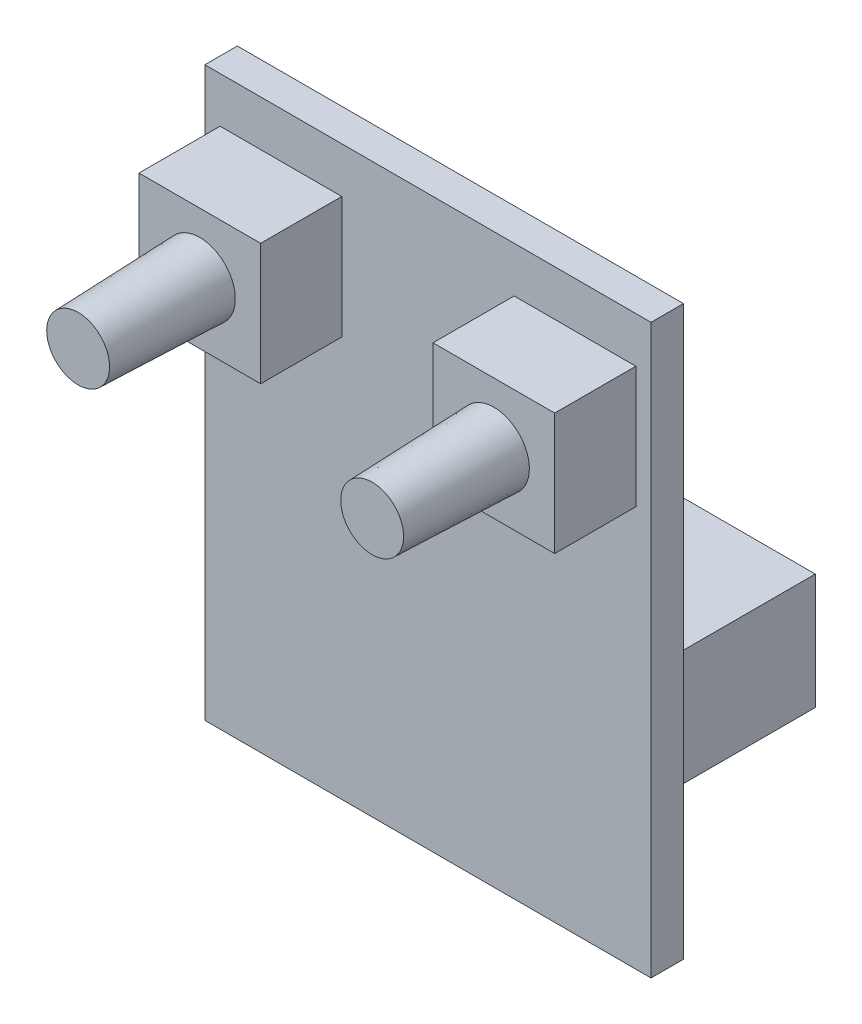
ISO-10303-21;
HEADER;
FILE_DESCRIPTION(('STEP AP214'),'2;1');
FILE_NAME('part.step','',(''),(''),'','','');
FILE_SCHEMA(('AUTOMOTIVE_DESIGN { 1 0 10303 214 1 1 1 1 }'));
ENDSEC;
DATA;
#1=APPLICATION_CONTEXT('core data for automotive mechanical design processes');
#2=APPLICATION_PROTOCOL_DEFINITION('international standard','automotive_design',2000,#1);
#3=PRODUCT_CONTEXT('',#1,'mechanical');
#4=PRODUCT('Part','Part','',(#3));
#5=PRODUCT_RELATED_PRODUCT_CATEGORY('part','',(#4));
#6=PRODUCT_DEFINITION_FORMATION('','',#4);
#7=PRODUCT_DEFINITION_CONTEXT('part definition',#1,'design');
#8=PRODUCT_DEFINITION('design','',#6,#7);
#9=PRODUCT_DEFINITION_SHAPE('','',#8);
#10=(LENGTH_UNIT() NAMED_UNIT(*) SI_UNIT(.MILLI.,.METRE.));
#11=(NAMED_UNIT(*) PLANE_ANGLE_UNIT() SI_UNIT($,.RADIAN.));
#12=(NAMED_UNIT(*) SI_UNIT($,.STERADIAN.) SOLID_ANGLE_UNIT());
#13=UNCERTAINTY_MEASURE_WITH_UNIT(LENGTH_MEASURE(1.E-05),#10,'distance_accuracy_value','');
#14=(GEOMETRIC_REPRESENTATION_CONTEXT(3) GLOBAL_UNCERTAINTY_ASSIGNED_CONTEXT((#13)) GLOBAL_UNIT_ASSIGNED_CONTEXT((#10,
#11,#12)) REPRESENTATION_CONTEXT('',''));
#15=CARTESIAN_POINT('',(0.,0.,0.));
#16=DIRECTION('',(0.,0.,1.));
#17=DIRECTION('',(1.,0.,0.));
#18=AXIS2_PLACEMENT_3D('',#15,#16,#17);
#19=CARTESIAN_POINT('',(0.,0.,5.6));
#20=DIRECTION('',(0.,0.,1.));
#21=DIRECTION('',(-1.,0.,0.));
#22=AXIS2_PLACEMENT_3D('',#19,#20,#21);
#23=PLANE('',#22);
#24=DIRECTION('',(0.,-1.,0.));
#25=VECTOR('',#24,1.);
#26=CARTESIAN_POINT('',(-4.25,25.75,5.6));
#27=LINE('',#26,#25);
#28=CARTESIAN_POINT('',(-4.25,25.75,5.6));
#29=VERTEX_POINT('',#28);
#30=CARTESIAN_POINT('',(-4.25,19.75,5.6));
#31=VERTEX_POINT('',#30);
#32=EDGE_CURVE('E181',#29,#31,#27,.T.);
#33=ORIENTED_EDGE('',*,*,#32,.F.);
#34=DIRECTION('',(1.,0.,0.));
#35=VECTOR('',#34,1.);
#36=CARTESIAN_POINT('',(-4.25,25.75,5.6));
#37=LINE('',#36,#35);
#38=CARTESIAN_POINT('',(-10.25,25.75,5.6));
#39=VERTEX_POINT('',#38);
#40=EDGE_CURVE('E196',#39,#29,#37,.T.);
#41=ORIENTED_EDGE('',*,*,#40,.F.);
#42=DIRECTION('',(0.,1.,0.));
#43=VECTOR('',#42,1.);
#44=CARTESIAN_POINT('',(-10.25,25.75,5.6));
#45=LINE('',#44,#43);
#46=CARTESIAN_POINT('',(-10.25,19.75,5.6));
#47=VERTEX_POINT('',#46);
#48=EDGE_CURVE('E203',#47,#39,#45,.T.);
#49=ORIENTED_EDGE('',*,*,#48,.F.);
#50=DIRECTION('',(-1.,0.,0.));
#51=VECTOR('',#50,1.);
#52=CARTESIAN_POINT('',(-4.25,19.75,5.6));
#53=LINE('',#52,#51);
#54=EDGE_CURVE('E199',#31,#47,#53,.T.);
#55=ORIENTED_EDGE('',*,*,#54,.F.);
#56=EDGE_LOOP('',(#33,#41,#49,#55));
#57=FACE_BOUND('',#56,.T.);
#58=CARTESIAN_POINT('',(-7.25,22.75,5.6));
#59=DIRECTION('',(0.,0.,-1.));
#60=DIRECTION('',(-1.,0.,0.));
#61=AXIS2_PLACEMENT_3D('',#58,#59,#60);
#62=CIRCLE('',#61,1.75);
#63=CARTESIAN_POINT('',(-9.,22.75,5.6));
#64=VERTEX_POINT('',#63);
#65=EDGE_CURVE('E212',#64,#64,#62,.T.);
#66=ORIENTED_EDGE('',*,*,#65,.T.);
#67=EDGE_LOOP('',(#66));
#68=FACE_BOUND('',#67,.T.);
#69=ADVANCED_FACE('F40',(#57,#68),#23,.T.);
#70=CARTESIAN_POINT('',(0.,0.,5.6));
#71=DIRECTION('',(0.,0.,1.));
#72=DIRECTION('',(1.,0.,0.));
#73=AXIS2_PLACEMENT_3D('',#70,#71,#72);
#74=PLANE('',#73);
#75=DIRECTION('',(0.,-1.,0.));
#76=VECTOR('',#75,1.);
#77=CARTESIAN_POINT('',(4.25,25.75,5.6));
#78=LINE('',#77,#76);
#79=CARTESIAN_POINT('',(4.25,25.75,5.6));
#80=VERTEX_POINT('',#79);
#81=CARTESIAN_POINT('',(4.25,19.75,5.6));
#82=VERTEX_POINT('',#81);
#83=EDGE_CURVE('E591',#80,#82,#78,.T.);
#84=ORIENTED_EDGE('',*,*,#83,.T.);
#85=DIRECTION('',(1.,0.,0.));
#86=VECTOR('',#85,1.);
#87=CARTESIAN_POINT('',(4.25,19.75,5.6));
#88=LINE('',#87,#86);
#89=CARTESIAN_POINT('',(10.25,19.75,5.6));
#90=VERTEX_POINT('',#89);
#91=EDGE_CURVE('E594',#82,#90,#88,.T.);
#92=ORIENTED_EDGE('',*,*,#91,.T.);
#93=DIRECTION('',(0.,1.,0.));
#94=VECTOR('',#93,1.);
#95=CARTESIAN_POINT('',(10.25,25.75,5.6));
#96=LINE('',#95,#94);
#97=CARTESIAN_POINT('',(10.25,25.75,5.6));
#98=VERTEX_POINT('',#97);
#99=EDGE_CURVE('E597',#90,#98,#96,.T.);
#100=ORIENTED_EDGE('',*,*,#99,.T.);
#101=DIRECTION('',(-1.,0.,0.));
#102=VECTOR('',#101,1.);
#103=CARTESIAN_POINT('',(4.25,25.75,5.6));
#104=LINE('',#103,#102);
#105=EDGE_CURVE('E599',#98,#80,#104,.T.);
#106=ORIENTED_EDGE('',*,*,#105,.T.);
#107=EDGE_LOOP('',(#84,#92,#100,#106));
#108=FACE_BOUND('',#107,.T.);
#109=CARTESIAN_POINT('',(7.25,22.75,5.6));
#110=DIRECTION('',(0.,0.,1.));
#111=DIRECTION('',(1.,0.,0.));
#112=AXIS2_PLACEMENT_3D('',#109,#110,#111);
#113=CIRCLE('',#112,1.75);
#114=CARTESIAN_POINT('',(9.,22.75,5.6));
#115=VERTEX_POINT('',#114);
#116=EDGE_CURVE('E525',#115,#115,#113,.T.);
#117=ORIENTED_EDGE('',*,*,#116,.F.);
#118=EDGE_LOOP('',(#117));
#119=FACE_BOUND('',#118,.T.);
#120=ADVANCED_FACE('F283',(#108,#119),#74,.T.);
#121=CARTESIAN_POINT('',(0.,0.,0.));
#122=DIRECTION('',(0.,0.,-1.));
#123=DIRECTION('',(-1.,0.,0.));
#124=AXIS2_PLACEMENT_3D('',#121,#122,#123);
#125=PLANE('',#124);
#126=DIRECTION('',(0.,-1.,0.));
#127=VECTOR('',#126,1.);
#128=CARTESIAN_POINT('',(-11.,0.,0.));
#129=LINE('',#128,#127);
#130=CARTESIAN_POINT('',(-11.,28.,0.));
#131=VERTEX_POINT('',#130);
#132=CARTESIAN_POINT('',(-11.,0.,0.));
#133=VERTEX_POINT('',#132);
#134=EDGE_CURVE('E623',#131,#133,#129,.T.);
#135=ORIENTED_EDGE('',*,*,#134,.F.);
#136=DIRECTION('',(-1.,0.,0.));
#137=VECTOR('',#136,1.);
#138=CARTESIAN_POINT('',(-11.,28.,0.));
#139=LINE('',#138,#137);
#140=CARTESIAN_POINT('',(11.,28.,0.));
#141=VERTEX_POINT('',#140);
#142=EDGE_CURVE('E628',#141,#131,#139,.T.);
#143=ORIENTED_EDGE('',*,*,#142,.F.);
#144=DIRECTION('',(0.,1.,0.));
#145=VECTOR('',#144,1.);
#146=CARTESIAN_POINT('',(11.,0.,0.));
#147=LINE('',#146,#145);
#148=CARTESIAN_POINT('',(11.,0.,0.));
#149=VERTEX_POINT('',#148);
#150=EDGE_CURVE('E639',#149,#141,#147,.T.);
#151=ORIENTED_EDGE('',*,*,#150,.F.);
#152=DIRECTION('',(1.,0.,0.));
#153=VECTOR('',#152,1.);
#154=CARTESIAN_POINT('',(-11.,0.,0.));
#155=LINE('',#154,#153);
#156=EDGE_CURVE('E637',#133,#149,#155,.T.);
#157=ORIENTED_EDGE('',*,*,#156,.F.);
#158=EDGE_LOOP('',(#135,#143,#151,#157));
#159=FACE_BOUND('',#158,.T.);
#160=DIRECTION('',(-1.,0.,0.));
#161=VECTOR('',#160,1.);
#162=CARTESIAN_POINT('',(10.5,7.,0.));
#163=LINE('',#162,#161);
#164=CARTESIAN_POINT('',(10.5,7.,0.));
#165=VERTEX_POINT('',#164);
#166=CARTESIAN_POINT('',(-2.,7.,0.));
#167=VERTEX_POINT('',#166);
#168=EDGE_CURVE('E575',#165,#167,#163,.T.);
#169=ORIENTED_EDGE('',*,*,#168,.F.);
#170=DIRECTION('',(0.,-1.,0.));
#171=VECTOR('',#170,1.);
#172=CARTESIAN_POINT('',(10.5,7.,0.));
#173=LINE('',#172,#171);
#174=CARTESIAN_POINT('',(10.5,12.7,0.));
#175=VERTEX_POINT('',#174);
#176=EDGE_CURVE('E561',#175,#165,#173,.T.);
#177=ORIENTED_EDGE('',*,*,#176,.F.);
#178=DIRECTION('',(1.,0.,0.));
#179=VECTOR('',#178,1.);
#180=CARTESIAN_POINT('',(10.5,12.7,0.));
#181=LINE('',#180,#179);
#182=CARTESIAN_POINT('',(-2.,12.7,0.));
#183=VERTEX_POINT('',#182);
#184=EDGE_CURVE('E566',#183,#175,#181,.T.);
#185=ORIENTED_EDGE('',*,*,#184,.F.);
#186=DIRECTION('',(0.,1.,0.));
#187=VECTOR('',#186,1.);
#188=CARTESIAN_POINT('',(-2.,7.,0.));
#189=LINE('',#188,#187);
#190=EDGE_CURVE('E577',#167,#183,#189,.T.);
#191=ORIENTED_EDGE('',*,*,#190,.F.);
#192=EDGE_LOOP('',(#169,#177,#185,#191));
#193=FACE_BOUND('',#192,.T.);
#194=DIRECTION('',(-1.,0.,0.));
#195=VECTOR('',#194,1.);
#196=CARTESIAN_POINT('',(-3.,7.,0.));
#197=LINE('',#196,#195);
#198=CARTESIAN_POINT('',(-3.,7.,0.));
#199=VERTEX_POINT('',#198);
#200=CARTESIAN_POINT('',(-10.5,7.,0.));
#201=VERTEX_POINT('',#200);
#202=EDGE_CURVE('E548',#199,#201,#197,.T.);
#203=ORIENTED_EDGE('',*,*,#202,.F.);
#204=DIRECTION('',(0.,-1.,0.));
#205=VECTOR('',#204,1.);
#206=CARTESIAN_POINT('',(-3.,7.,0.));
#207=LINE('',#206,#205);
#208=CARTESIAN_POINT('',(-3.,12.7,0.));
#209=VERTEX_POINT('',#208);
#210=EDGE_CURVE('E528',#209,#199,#207,.T.);
#211=ORIENTED_EDGE('',*,*,#210,.F.);
#212=DIRECTION('',(1.,0.,0.));
#213=VECTOR('',#212,1.);
#214=CARTESIAN_POINT('',(-3.,12.7,0.));
#215=LINE('',#214,#213);
#216=CARTESIAN_POINT('',(-10.5,12.7,0.));
#217=VERTEX_POINT('',#216);
#218=EDGE_CURVE('E539',#217,#209,#215,.T.);
#219=ORIENTED_EDGE('',*,*,#218,.F.);
#220=DIRECTION('',(0.,1.,0.));
#221=VECTOR('',#220,1.);
#222=CARTESIAN_POINT('',(-10.5,7.,0.));
#223=LINE('',#222,#221);
#224=EDGE_CURVE('E550',#201,#217,#223,.T.);
#225=ORIENTED_EDGE('',*,*,#224,.F.);
#226=EDGE_LOOP('',(#203,#211,#219,#225));
#227=FACE_BOUND('',#226,.T.);
#228=ADVANCED_FACE('F286',(#159,#193,#227),#125,.T.);
#229=CARTESIAN_POINT('',(0.,0.,1.6));
#230=DIRECTION('',(0.,0.,-1.));
#231=DIRECTION('',(-1.,0.,0.));
#232=AXIS2_PLACEMENT_3D('',#229,#230,#231);
#233=PLANE('',#232);
#234=DIRECTION('',(1.,0.,0.));
#235=VECTOR('',#234,1.);
#236=CARTESIAN_POINT('',(-4.25,25.75,1.6));
#237=LINE('',#236,#235);
#238=CARTESIAN_POINT('',(-10.25,25.75,1.6));
#239=VERTEX_POINT('',#238);
#240=CARTESIAN_POINT('',(-4.25,25.75,1.6));
#241=VERTEX_POINT('',#240);
#242=EDGE_CURVE('E211',#239,#241,#237,.T.);
#243=ORIENTED_EDGE('',*,*,#242,.T.);
#244=DIRECTION('',(0.,-1.,0.));
#245=VECTOR('',#244,1.);
#246=CARTESIAN_POINT('',(-4.25,25.75,1.6));
#247=LINE('',#246,#245);
#248=CARTESIAN_POINT('',(-4.25,19.75,1.6));
#249=VERTEX_POINT('',#248);
#250=EDGE_CURVE('E184',#241,#249,#247,.T.);
#251=ORIENTED_EDGE('',*,*,#250,.T.);
#252=DIRECTION('',(-1.,0.,0.));
#253=VECTOR('',#252,1.);
#254=CARTESIAN_POINT('',(-4.25,19.75,1.6));
#255=LINE('',#254,#253);
#256=CARTESIAN_POINT('',(-10.25,19.75,1.6));
#257=VERTEX_POINT('',#256);
#258=EDGE_CURVE('E200',#249,#257,#255,.T.);
#259=ORIENTED_EDGE('',*,*,#258,.T.);
#260=DIRECTION('',(0.,1.,0.));
#261=VECTOR('',#260,1.);
#262=CARTESIAN_POINT('',(-10.25,25.75,1.6));
#263=LINE('',#262,#261);
#264=EDGE_CURVE('E55',#257,#239,#263,.T.);
#265=ORIENTED_EDGE('',*,*,#264,.T.);
#266=EDGE_LOOP('',(#243,#251,#259,#265));
#267=FACE_BOUND('',#266,.T.);
#268=DIRECTION('',(0.,-1.,0.));
#269=VECTOR('',#268,1.);
#270=CARTESIAN_POINT('',(-11.,0.,1.6));
#271=LINE('',#270,#269);
#272=CARTESIAN_POINT('',(-11.,28.,1.6));
#273=VERTEX_POINT('',#272);
#274=CARTESIAN_POINT('',(-11.,0.,1.6));
#275=VERTEX_POINT('',#274);
#276=EDGE_CURVE('E624',#273,#275,#271,.T.);
#277=ORIENTED_EDGE('',*,*,#276,.T.);
#278=DIRECTION('',(1.,0.,0.));
#279=VECTOR('',#278,1.);
#280=CARTESIAN_POINT('',(-11.,0.,1.6));
#281=LINE('',#280,#279);
#282=CARTESIAN_POINT('',(11.,0.,1.6));
#283=VERTEX_POINT('',#282);
#284=EDGE_CURVE('E627',#275,#283,#281,.T.);
#285=ORIENTED_EDGE('',*,*,#284,.T.);
#286=DIRECTION('',(0.,1.,0.));
#287=VECTOR('',#286,1.);
#288=CARTESIAN_POINT('',(11.,0.,1.6));
#289=LINE('',#288,#287);
#290=CARTESIAN_POINT('',(11.,28.,1.6));
#291=VERTEX_POINT('',#290);
#292=EDGE_CURVE('E630',#283,#291,#289,.T.);
#293=ORIENTED_EDGE('',*,*,#292,.T.);
#294=DIRECTION('',(-1.,0.,0.));
#295=VECTOR('',#294,1.);
#296=CARTESIAN_POINT('',(-11.,28.,1.6));
#297=LINE('',#296,#295);
#298=EDGE_CURVE('E632',#291,#273,#297,.T.);
#299=ORIENTED_EDGE('',*,*,#298,.T.);
#300=EDGE_LOOP('',(#277,#285,#293,#299));
#301=FACE_BOUND('',#300,.T.);
#302=DIRECTION('',(0.,-1.,0.));
#303=VECTOR('',#302,1.);
#304=CARTESIAN_POINT('',(4.25,25.75,1.6));
#305=LINE('',#304,#303);
#306=CARTESIAN_POINT('',(4.25,25.75,1.6));
#307=VERTEX_POINT('',#306);
#308=CARTESIAN_POINT('',(4.25,19.75,1.6));
#309=VERTEX_POINT('',#308);
#310=EDGE_CURVE('E590',#307,#309,#305,.T.);
#311=ORIENTED_EDGE('',*,*,#310,.F.);
#312=DIRECTION('',(-1.,0.,0.));
#313=VECTOR('',#312,1.);
#314=CARTESIAN_POINT('',(4.25,25.75,1.6));
#315=LINE('',#314,#313);
#316=CARTESIAN_POINT('',(10.25,25.75,1.6));
#317=VERTEX_POINT('',#316);
#318=EDGE_CURVE('E595',#317,#307,#315,.T.);
#319=ORIENTED_EDGE('',*,*,#318,.F.);
#320=DIRECTION('',(0.,1.,0.));
#321=VECTOR('',#320,1.);
#322=CARTESIAN_POINT('',(10.25,25.75,1.6));
#323=LINE('',#322,#321);
#324=CARTESIAN_POINT('',(10.25,19.75,1.6));
#325=VERTEX_POINT('',#324);
#326=EDGE_CURVE('E607',#325,#317,#323,.T.);
#327=ORIENTED_EDGE('',*,*,#326,.F.);
#328=DIRECTION('',(1.,0.,0.));
#329=VECTOR('',#328,1.);
#330=CARTESIAN_POINT('',(4.25,19.75,1.6));
#331=LINE('',#330,#329);
#332=EDGE_CURVE('E604',#309,#325,#331,.T.);
#333=ORIENTED_EDGE('',*,*,#332,.F.);
#334=EDGE_LOOP('',(#311,#319,#327,#333));
#335=FACE_BOUND('',#334,.T.);
#336=ADVANCED_FACE('F304',(#267,#301,#335),#233,.F.);
#337=CARTESIAN_POINT('',(-11.,0.,1.6));
#338=DIRECTION('',(1.,0.,0.));
#339=DIRECTION('',(0.,0.,-1.));
#340=AXIS2_PLACEMENT_3D('',#337,#338,#339);
#341=PLANE('',#340);
#342=ORIENTED_EDGE('',*,*,#134,.T.);
#343=DIRECTION('',(0.,0.,-1.));
#344=VECTOR('',#343,1.);
#345=CARTESIAN_POINT('',(-11.,0.,1.6));
#346=LINE('',#345,#344);
#347=EDGE_CURVE('E12',#275,#133,#346,.T.);
#348=ORIENTED_EDGE('',*,*,#347,.F.);
#349=ORIENTED_EDGE('',*,*,#276,.F.);
#350=DIRECTION('',(0.,0.,-1.));
#351=VECTOR('',#350,1.);
#352=CARTESIAN_POINT('',(-11.,28.,1.6));
#353=LINE('',#352,#351);
#354=EDGE_CURVE('E634',#273,#131,#353,.T.);
#355=ORIENTED_EDGE('',*,*,#354,.T.);
#356=EDGE_LOOP('',(#342,#348,#349,#355));
#357=FACE_BOUND('',#356,.T.);
#358=ADVANCED_FACE('F42',(#357),#341,.F.);
#359=CARTESIAN_POINT('',(-11.,0.,1.6));
#360=DIRECTION('',(0.,1.,0.));
#361=DIRECTION('',(0.,0.,1.));
#362=AXIS2_PLACEMENT_3D('',#359,#360,#361);
#363=PLANE('',#362);
#364=ORIENTED_EDGE('',*,*,#156,.T.);
#365=DIRECTION('',(0.,0.,-1.));
#366=VECTOR('',#365,1.);
#367=CARTESIAN_POINT('',(11.,0.,1.6));
#368=LINE('',#367,#366);
#369=EDGE_CURVE('E48',#283,#149,#368,.T.);
#370=ORIENTED_EDGE('',*,*,#369,.F.);
#371=ORIENTED_EDGE('',*,*,#284,.F.);
#372=ORIENTED_EDGE('',*,*,#347,.T.);
#373=EDGE_LOOP('',(#364,#370,#371,#372));
#374=FACE_BOUND('',#373,.T.);
#375=ADVANCED_FACE('F316',(#374),#363,.F.);
#376=CARTESIAN_POINT('',(11.,0.,1.6));
#377=DIRECTION('',(-1.,0.,0.));
#378=DIRECTION('',(0.,0.,1.));
#379=AXIS2_PLACEMENT_3D('',#376,#377,#378);
#380=PLANE('',#379);
#381=ORIENTED_EDGE('',*,*,#150,.T.);
#382=DIRECTION('',(0.,0.,-1.));
#383=VECTOR('',#382,1.);
#384=CARTESIAN_POINT('',(11.,28.,1.6));
#385=LINE('',#384,#383);
#386=EDGE_CURVE('E644',#291,#141,#385,.T.);
#387=ORIENTED_EDGE('',*,*,#386,.F.);
#388=ORIENTED_EDGE('',*,*,#292,.F.);
#389=ORIENTED_EDGE('',*,*,#369,.T.);
#390=EDGE_LOOP('',(#381,#387,#388,#389));
#391=FACE_BOUND('',#390,.T.);
#392=ADVANCED_FACE('F313',(#391),#380,.F.);
#393=CARTESIAN_POINT('',(-11.,28.,1.6));
#394=DIRECTION('',(0.,-1.,0.));
#395=DIRECTION('',(0.,0.,-1.));
#396=AXIS2_PLACEMENT_3D('',#393,#394,#395);
#397=PLANE('',#396);
#398=ORIENTED_EDGE('',*,*,#142,.T.);
#399=ORIENTED_EDGE('',*,*,#354,.F.);
#400=ORIENTED_EDGE('',*,*,#298,.F.);
#401=ORIENTED_EDGE('',*,*,#386,.T.);
#402=EDGE_LOOP('',(#398,#399,#400,#401));
#403=FACE_BOUND('',#402,.T.);
#404=ADVANCED_FACE('F302',(#403),#397,.F.);
#405=CARTESIAN_POINT('',(4.25,25.75,5.6));
#406=DIRECTION('',(1.,0.,0.));
#407=DIRECTION('',(0.,0.,-1.));
#408=AXIS2_PLACEMENT_3D('',#405,#406,#407);
#409=PLANE('',#408);
#410=ORIENTED_EDGE('',*,*,#310,.T.);
#411=DIRECTION('',(0.,0.,-1.));
#412=VECTOR('',#411,1.);
#413=CARTESIAN_POINT('',(4.25,19.75,5.6));
#414=LINE('',#413,#412);
#415=EDGE_CURVE('E620',#82,#309,#414,.T.);
#416=ORIENTED_EDGE('',*,*,#415,.F.);
#417=ORIENTED_EDGE('',*,*,#83,.F.);
#418=DIRECTION('',(0.,0.,-1.));
#419=VECTOR('',#418,1.);
#420=CARTESIAN_POINT('',(4.25,25.75,5.6));
#421=LINE('',#420,#419);
#422=EDGE_CURVE('E601',#80,#307,#421,.T.);
#423=ORIENTED_EDGE('',*,*,#422,.T.);
#424=EDGE_LOOP('',(#410,#416,#417,#423));
#425=FACE_BOUND('',#424,.T.);
#426=ADVANCED_FACE('F298',(#425),#409,.F.);
#427=CARTESIAN_POINT('',(4.25,19.75,5.6));
#428=DIRECTION('',(0.,1.,0.));
#429=DIRECTION('',(0.,0.,1.));
#430=AXIS2_PLACEMENT_3D('',#427,#428,#429);
#431=PLANE('',#430);
#432=ORIENTED_EDGE('',*,*,#332,.T.);
#433=DIRECTION('',(0.,0.,-1.));
#434=VECTOR('',#433,1.);
#435=CARTESIAN_POINT('',(10.25,19.75,5.6));
#436=LINE('',#435,#434);
#437=EDGE_CURVE('E617',#90,#325,#436,.T.);
#438=ORIENTED_EDGE('',*,*,#437,.F.);
#439=ORIENTED_EDGE('',*,*,#91,.F.);
#440=ORIENTED_EDGE('',*,*,#415,.T.);
#441=EDGE_LOOP('',(#432,#438,#439,#440));
#442=FACE_BOUND('',#441,.T.);
#443=ADVANCED_FACE('F294',(#442),#431,.F.);
#444=CARTESIAN_POINT('',(10.25,25.75,5.6));
#445=DIRECTION('',(-1.,0.,0.));
#446=DIRECTION('',(0.,0.,1.));
#447=AXIS2_PLACEMENT_3D('',#444,#445,#446);
#448=PLANE('',#447);
#449=ORIENTED_EDGE('',*,*,#326,.T.);
#450=DIRECTION('',(0.,0.,-1.));
#451=VECTOR('',#450,1.);
#452=CARTESIAN_POINT('',(10.25,25.75,5.6));
#453=LINE('',#452,#451);
#454=EDGE_CURVE('E614',#98,#317,#453,.T.);
#455=ORIENTED_EDGE('',*,*,#454,.F.);
#456=ORIENTED_EDGE('',*,*,#99,.F.);
#457=ORIENTED_EDGE('',*,*,#437,.T.);
#458=EDGE_LOOP('',(#449,#455,#456,#457));
#459=FACE_BOUND('',#458,.T.);
#460=ADVANCED_FACE('F290',(#459),#448,.F.);
#461=CARTESIAN_POINT('',(4.25,25.75,5.6));
#462=DIRECTION('',(0.,-1.,0.));
#463=DIRECTION('',(0.,0.,-1.));
#464=AXIS2_PLACEMENT_3D('',#461,#462,#463);
#465=PLANE('',#464);
#466=ORIENTED_EDGE('',*,*,#318,.T.);
#467=ORIENTED_EDGE('',*,*,#422,.F.);
#468=ORIENTED_EDGE('',*,*,#105,.F.);
#469=ORIENTED_EDGE('',*,*,#454,.T.);
#470=EDGE_LOOP('',(#466,#467,#468,#469));
#471=FACE_BOUND('',#470,.T.);
#472=ADVANCED_FACE('F281',(#471),#465,.F.);
#473=CARTESIAN_POINT('',(10.5,7.,-7.));
#474=DIRECTION('',(-1.,0.,0.));
#475=DIRECTION('',(0.,0.,1.));
#476=AXIS2_PLACEMENT_3D('',#473,#474,#475);
#477=PLANE('',#476);
#478=ORIENTED_EDGE('',*,*,#176,.T.);
#479=DIRECTION('',(0.,0.,1.));
#480=VECTOR('',#479,1.);
#481=CARTESIAN_POINT('',(10.5,7.,-7.));
#482=LINE('',#481,#480);
#483=CARTESIAN_POINT('',(10.5,7.,-7.));
#484=VERTEX_POINT('',#483);
#485=EDGE_CURVE('E588',#484,#165,#482,.T.);
#486=ORIENTED_EDGE('',*,*,#485,.F.);
#487=DIRECTION('',(0.,-1.,0.));
#488=VECTOR('',#487,1.);
#489=CARTESIAN_POINT('',(10.5,7.,-7.));
#490=LINE('',#489,#488);
#491=CARTESIAN_POINT('',(10.5,12.7,-7.));
#492=VERTEX_POINT('',#491);
#493=EDGE_CURVE('E562',#492,#484,#490,.T.);
#494=ORIENTED_EDGE('',*,*,#493,.F.);
#495=DIRECTION('',(0.,0.,1.));
#496=VECTOR('',#495,1.);
#497=CARTESIAN_POINT('',(10.5,12.7,-7.));
#498=LINE('',#497,#496);
#499=EDGE_CURVE('E572',#492,#175,#498,.T.);
#500=ORIENTED_EDGE('',*,*,#499,.T.);
#501=EDGE_LOOP('',(#478,#486,#494,#500));
#502=FACE_BOUND('',#501,.T.);
#503=ADVANCED_FACE('F277',(#502),#477,.F.);
#504=CARTESIAN_POINT('',(10.5,7.,-7.));
#505=DIRECTION('',(0.,1.,0.));
#506=DIRECTION('',(0.,0.,1.));
#507=AXIS2_PLACEMENT_3D('',#504,#505,#506);
#508=PLANE('',#507);
#509=ORIENTED_EDGE('',*,*,#168,.T.);
#510=DIRECTION('',(0.,0.,1.));
#511=VECTOR('',#510,1.);
#512=CARTESIAN_POINT('',(-2.,7.,-7.));
#513=LINE('',#512,#511);
#514=CARTESIAN_POINT('',(-2.,7.,-7.));
#515=VERTEX_POINT('',#514);
#516=EDGE_CURVE('E585',#515,#167,#513,.T.);
#517=ORIENTED_EDGE('',*,*,#516,.F.);
#518=DIRECTION('',(-1.,0.,0.));
#519=VECTOR('',#518,1.);
#520=CARTESIAN_POINT('',(10.5,7.,-7.));
#521=LINE('',#520,#519);
#522=EDGE_CURVE('E565',#484,#515,#521,.T.);
#523=ORIENTED_EDGE('',*,*,#522,.F.);
#524=ORIENTED_EDGE('',*,*,#485,.T.);
#525=EDGE_LOOP('',(#509,#517,#523,#524));
#526=FACE_BOUND('',#525,.T.);
#527=ADVANCED_FACE('F273',(#526),#508,.F.);
#528=CARTESIAN_POINT('',(-2.,7.,-7.));
#529=DIRECTION('',(1.,0.,0.));
#530=DIRECTION('',(0.,1.,0.));
#531=AXIS2_PLACEMENT_3D('',#528,#529,#530);
#532=PLANE('',#531);
#533=ORIENTED_EDGE('',*,*,#190,.T.);
#534=DIRECTION('',(0.,0.,1.));
#535=VECTOR('',#534,1.);
#536=CARTESIAN_POINT('',(-2.,12.7,-7.));
#537=LINE('',#536,#535);
#538=CARTESIAN_POINT('',(-2.,12.7,-7.));
#539=VERTEX_POINT('',#538);
#540=EDGE_CURVE('E583',#539,#183,#537,.T.);
#541=ORIENTED_EDGE('',*,*,#540,.F.);
#542=DIRECTION('',(0.,1.,0.));
#543=VECTOR('',#542,1.);
#544=CARTESIAN_POINT('',(-2.,7.,-7.));
#545=LINE('',#544,#543);
#546=EDGE_CURVE('E568',#515,#539,#545,.T.);
#547=ORIENTED_EDGE('',*,*,#546,.F.);
#548=ORIENTED_EDGE('',*,*,#516,.T.);
#549=EDGE_LOOP('',(#533,#541,#547,#548));
#550=FACE_BOUND('',#549,.T.);
#551=ADVANCED_FACE('F269',(#550),#532,.F.);
#552=CARTESIAN_POINT('',(10.5,12.7,-7.));
#553=DIRECTION('',(0.,-1.,0.));
#554=DIRECTION('',(0.,0.,-1.));
#555=AXIS2_PLACEMENT_3D('',#552,#553,#554);
#556=PLANE('',#555);
#557=ORIENTED_EDGE('',*,*,#184,.T.);
#558=ORIENTED_EDGE('',*,*,#499,.F.);
#559=DIRECTION('',(1.,0.,0.));
#560=VECTOR('',#559,1.);
#561=CARTESIAN_POINT('',(10.5,12.7,-7.));
#562=LINE('',#561,#560);
#563=EDGE_CURVE('E570',#539,#492,#562,.T.);
#564=ORIENTED_EDGE('',*,*,#563,.F.);
#565=ORIENTED_EDGE('',*,*,#540,.T.);
#566=EDGE_LOOP('',(#557,#558,#564,#565));
#567=FACE_BOUND('',#566,.T.);
#568=ADVANCED_FACE('F265',(#567),#556,.F.);
#569=CARTESIAN_POINT('',(0.,0.,-7.));
#570=DIRECTION('',(0.,0.,1.));
#571=DIRECTION('',(1.,0.,0.));
#572=AXIS2_PLACEMENT_3D('',#569,#570,#571);
#573=PLANE('',#572);
#574=ORIENTED_EDGE('',*,*,#493,.T.);
#575=ORIENTED_EDGE('',*,*,#522,.T.);
#576=ORIENTED_EDGE('',*,*,#546,.T.);
#577=ORIENTED_EDGE('',*,*,#563,.T.);
#578=EDGE_LOOP('',(#574,#575,#576,#577));
#579=FACE_BOUND('',#578,.T.);
#580=ADVANCED_FACE('F261',(#579),#573,.F.);
#581=CARTESIAN_POINT('',(-3.,7.,-7.));
#582=DIRECTION('',(-1.,0.,0.));
#583=DIRECTION('',(0.,-1.,0.));
#584=AXIS2_PLACEMENT_3D('',#581,#582,#583);
#585=PLANE('',#584);
#586=ORIENTED_EDGE('',*,*,#210,.T.);
#587=DIRECTION('',(0.,0.,1.));
#588=VECTOR('',#587,1.);
#589=CARTESIAN_POINT('',(-3.,7.,-7.));
#590=LINE('',#589,#588);
#591=CARTESIAN_POINT('',(-3.,7.,-7.));
#592=VERTEX_POINT('',#591);
#593=EDGE_CURVE('E559',#592,#199,#590,.T.);
#594=ORIENTED_EDGE('',*,*,#593,.F.);
#595=DIRECTION('',(0.,-1.,0.));
#596=VECTOR('',#595,1.);
#597=CARTESIAN_POINT('',(-3.,7.,-7.));
#598=LINE('',#597,#596);
#599=CARTESIAN_POINT('',(-3.,12.7,-7.));
#600=VERTEX_POINT('',#599);
#601=EDGE_CURVE('E535',#600,#592,#598,.T.);
#602=ORIENTED_EDGE('',*,*,#601,.F.);
#603=DIRECTION('',(0.,0.,1.));
#604=VECTOR('',#603,1.);
#605=CARTESIAN_POINT('',(-3.,12.7,-7.));
#606=LINE('',#605,#604);
#607=EDGE_CURVE('E545',#600,#209,#606,.T.);
#608=ORIENTED_EDGE('',*,*,#607,.T.);
#609=EDGE_LOOP('',(#586,#594,#602,#608));
#610=FACE_BOUND('',#609,.T.);
#611=ADVANCED_FACE('F257',(#610),#585,.F.);
#612=CARTESIAN_POINT('',(-3.,7.,-7.));
#613=DIRECTION('',(0.,1.,0.));
#614=DIRECTION('',(0.,0.,1.));
#615=AXIS2_PLACEMENT_3D('',#612,#613,#614);
#616=PLANE('',#615);
#617=ORIENTED_EDGE('',*,*,#202,.T.);
#618=DIRECTION('',(0.,0.,1.));
#619=VECTOR('',#618,1.);
#620=CARTESIAN_POINT('',(-10.5,7.,-7.));
#621=LINE('',#620,#619);
#622=CARTESIAN_POINT('',(-10.5,7.,-7.));
#623=VERTEX_POINT('',#622);
#624=EDGE_CURVE('E556',#623,#201,#621,.T.);
#625=ORIENTED_EDGE('',*,*,#624,.F.);
#626=DIRECTION('',(-1.,0.,0.));
#627=VECTOR('',#626,1.);
#628=CARTESIAN_POINT('',(-3.,7.,-7.));
#629=LINE('',#628,#627);
#630=EDGE_CURVE('E538',#592,#623,#629,.T.);
#631=ORIENTED_EDGE('',*,*,#630,.F.);
#632=ORIENTED_EDGE('',*,*,#593,.T.);
#633=EDGE_LOOP('',(#617,#625,#631,#632));
#634=FACE_BOUND('',#633,.T.);
#635=ADVANCED_FACE('F253',(#634),#616,.F.);
#636=CARTESIAN_POINT('',(-10.5,7.,-7.));
#637=DIRECTION('',(1.,0.,0.));
#638=DIRECTION('',(0.,0.,-1.));
#639=AXIS2_PLACEMENT_3D('',#636,#637,#638);
#640=PLANE('',#639);
#641=ORIENTED_EDGE('',*,*,#224,.T.);
#642=DIRECTION('',(0.,0.,1.));
#643=VECTOR('',#642,1.);
#644=CARTESIAN_POINT('',(-10.5,12.7,-7.));
#645=LINE('',#644,#643);
#646=CARTESIAN_POINT('',(-10.5,12.7,-7.));
#647=VERTEX_POINT('',#646);
#648=EDGE_CURVE('E63',#647,#217,#645,.T.);
#649=ORIENTED_EDGE('',*,*,#648,.F.);
#650=DIRECTION('',(0.,1.,0.));
#651=VECTOR('',#650,1.);
#652=CARTESIAN_POINT('',(-10.5,7.,-7.));
#653=LINE('',#652,#651);
#654=EDGE_CURVE('E541',#623,#647,#653,.T.);
#655=ORIENTED_EDGE('',*,*,#654,.F.);
#656=ORIENTED_EDGE('',*,*,#624,.T.);
#657=EDGE_LOOP('',(#641,#649,#655,#656));
#658=FACE_BOUND('',#657,.T.);
#659=ADVANCED_FACE('F250',(#658),#640,.F.);
#660=CARTESIAN_POINT('',(-3.,12.7,-7.));
#661=DIRECTION('',(0.,-1.,0.));
#662=DIRECTION('',(0.,0.,-1.));
#663=AXIS2_PLACEMENT_3D('',#660,#661,#662);
#664=PLANE('',#663);
#665=ORIENTED_EDGE('',*,*,#218,.T.);
#666=ORIENTED_EDGE('',*,*,#607,.F.);
#667=DIRECTION('',(1.,0.,0.));
#668=VECTOR('',#667,1.);
#669=CARTESIAN_POINT('',(-3.,12.7,-7.));
#670=LINE('',#669,#668);
#671=EDGE_CURVE('E543',#647,#600,#670,.T.);
#672=ORIENTED_EDGE('',*,*,#671,.F.);
#673=ORIENTED_EDGE('',*,*,#648,.T.);
#674=EDGE_LOOP('',(#665,#666,#672,#673));
#675=FACE_BOUND('',#674,.T.);
#676=ADVANCED_FACE('F246',(#675),#664,.F.);
#677=CARTESIAN_POINT('',(0.,0.,-7.));
#678=DIRECTION('',(0.,0.,1.));
#679=DIRECTION('',(1.,0.,0.));
#680=AXIS2_PLACEMENT_3D('',#677,#678,#679);
#681=PLANE('',#680);
#682=ORIENTED_EDGE('',*,*,#601,.T.);
#683=ORIENTED_EDGE('',*,*,#630,.T.);
#684=ORIENTED_EDGE('',*,*,#654,.T.);
#685=ORIENTED_EDGE('',*,*,#671,.T.);
#686=EDGE_LOOP('',(#682,#683,#684,#685));
#687=FACE_BOUND('',#686,.T.);
#688=ADVANCED_FACE('F243',(#687),#681,.F.);
#689=CARTESIAN_POINT('',(7.25,22.75,11.6));
#690=DIRECTION('',(0.,0.,1.));
#691=DIRECTION('',(1.,0.,0.));
#692=AXIS2_PLACEMENT_3D('',#689,#690,#691);
#693=PLANE('',#692);
#694=CARTESIAN_POINT('',(7.25,22.75,11.6));
#695=DIRECTION('',(0.,0.,1.));
#696=DIRECTION('',(1.,0.,0.));
#697=AXIS2_PLACEMENT_3D('',#694,#695,#696);
#698=CIRCLE('',#697,1.55);
#699=CARTESIAN_POINT('',(8.8,22.75,11.6));
#700=VERTEX_POINT('',#699);
#701=EDGE_CURVE('E189',#700,#700,#698,.T.);
#702=ORIENTED_EDGE('',*,*,#701,.T.);
#703=EDGE_LOOP('',(#702));
#704=FACE_BOUND('',#703,.T.);
#705=ADVANCED_FACE('F240',(#704),#693,.T.);
#706=CARTESIAN_POINT('',(7.25,22.75,11.6));
#707=DIRECTION('',(0.,0.,-1.));
#708=DIRECTION('',(-1.,0.,0.));
#709=AXIS2_PLACEMENT_3D('',#706,#707,#708);
#710=CONICAL_SURFACE('',#709,1.55,0.0333209958782477);
#711=ORIENTED_EDGE('',*,*,#701,.F.);
#712=EDGE_LOOP('',(#711));
#713=FACE_BOUND('',#712,.T.);
#714=ORIENTED_EDGE('',*,*,#116,.T.);
#715=EDGE_LOOP('',(#714));
#716=FACE_BOUND('',#715,.T.);
#717=ADVANCED_FACE('F230',(#713,#716),#710,.T.);
#718=CARTESIAN_POINT('',(-4.25,25.75,5.6));
#719=DIRECTION('',(1.,0.,0.));
#720=DIRECTION('',(0.,0.,-1.));
#721=AXIS2_PLACEMENT_3D('',#718,#719,#720);
#722=PLANE('',#721);
#723=ORIENTED_EDGE('',*,*,#250,.F.);
#724=DIRECTION('',(0.,0.,-1.));
#725=VECTOR('',#724,1.);
#726=CARTESIAN_POINT('',(-4.25,25.75,5.6));
#727=LINE('',#726,#725);
#728=EDGE_CURVE('E178',#29,#241,#727,.T.);
#729=ORIENTED_EDGE('',*,*,#728,.F.);
#730=ORIENTED_EDGE('',*,*,#32,.T.);
#731=DIRECTION('',(0.,0.,-1.));
#732=VECTOR('',#731,1.);
#733=CARTESIAN_POINT('',(-4.25,19.75,5.6));
#734=LINE('',#733,#732);
#735=EDGE_CURVE('E209',#31,#249,#734,.T.);
#736=ORIENTED_EDGE('',*,*,#735,.T.);
#737=EDGE_LOOP('',(#723,#729,#730,#736));
#738=FACE_BOUND('',#737,.T.);
#739=ADVANCED_FACE('F180',(#738),#722,.T.);
#740=CARTESIAN_POINT('',(-4.25,25.75,5.6));
#741=DIRECTION('',(0.,1.,0.));
#742=DIRECTION('',(0.,0.,1.));
#743=AXIS2_PLACEMENT_3D('',#740,#741,#742);
#744=PLANE('',#743);
#745=ORIENTED_EDGE('',*,*,#242,.F.);
#746=DIRECTION('',(0.,0.,-1.));
#747=VECTOR('',#746,1.);
#748=CARTESIAN_POINT('',(-10.25,25.75,5.6));
#749=LINE('',#748,#747);
#750=EDGE_CURVE('E190',#39,#239,#749,.T.);
#751=ORIENTED_EDGE('',*,*,#750,.F.);
#752=ORIENTED_EDGE('',*,*,#40,.T.);
#753=ORIENTED_EDGE('',*,*,#728,.T.);
#754=EDGE_LOOP('',(#745,#751,#752,#753));
#755=FACE_BOUND('',#754,.T.);
#756=ADVANCED_FACE('F202',(#755),#744,.T.);
#757=CARTESIAN_POINT('',(-10.25,25.75,5.6));
#758=DIRECTION('',(-1.,0.,0.));
#759=DIRECTION('',(0.,0.,1.));
#760=AXIS2_PLACEMENT_3D('',#757,#758,#759);
#761=PLANE('',#760);
#762=ORIENTED_EDGE('',*,*,#264,.F.);
#763=DIRECTION('',(0.,0.,-1.));
#764=VECTOR('',#763,1.);
#765=CARTESIAN_POINT('',(-10.25,19.75,5.6));
#766=LINE('',#765,#764);
#767=EDGE_CURVE('E218',#47,#257,#766,.T.);
#768=ORIENTED_EDGE('',*,*,#767,.F.);
#769=ORIENTED_EDGE('',*,*,#48,.T.);
#770=ORIENTED_EDGE('',*,*,#750,.T.);
#771=EDGE_LOOP('',(#762,#768,#769,#770));
#772=FACE_BOUND('',#771,.T.);
#773=ADVANCED_FACE('F337',(#772),#761,.T.);
#774=CARTESIAN_POINT('',(-4.25,19.75,5.6));
#775=DIRECTION('',(0.,-1.,0.));
#776=DIRECTION('',(0.,0.,-1.));
#777=AXIS2_PLACEMENT_3D('',#774,#775,#776);
#778=PLANE('',#777);
#779=ORIENTED_EDGE('',*,*,#258,.F.);
#780=ORIENTED_EDGE('',*,*,#735,.F.);
#781=ORIENTED_EDGE('',*,*,#54,.T.);
#782=ORIENTED_EDGE('',*,*,#767,.T.);
#783=EDGE_LOOP('',(#779,#780,#781,#782));
#784=FACE_BOUND('',#783,.T.);
#785=ADVANCED_FACE('F333',(#784),#778,.T.);
#786=CARTESIAN_POINT('',(-7.25,22.75,11.6));
#787=DIRECTION('',(0.,0.,1.));
#788=DIRECTION('',(-1.,0.,0.));
#789=AXIS2_PLACEMENT_3D('',#786,#787,#788);
#790=PLANE('',#789);
#791=CARTESIAN_POINT('',(-7.25,22.75,11.6));
#792=DIRECTION('',(0.,0.,-1.));
#793=DIRECTION('',(-1.,0.,0.));
#794=AXIS2_PLACEMENT_3D('',#791,#792,#793);
#795=CIRCLE('',#794,1.55);
#796=CARTESIAN_POINT('',(-8.8,22.75,11.6));
#797=VERTEX_POINT('',#796);
#798=EDGE_CURVE('E699',#797,#797,#795,.T.);
#799=ORIENTED_EDGE('',*,*,#798,.F.);
#800=EDGE_LOOP('',(#799));
#801=FACE_BOUND('',#800,.T.);
#802=ADVANCED_FACE('F336',(#801),#790,.T.);
#803=CARTESIAN_POINT('',(-7.25,22.75,11.6));
#804=DIRECTION('',(0.,0.,-1.));
#805=DIRECTION('',(1.,0.,0.));
#806=AXIS2_PLACEMENT_3D('',#803,#804,#805);
#807=CONICAL_SURFACE('',#806,1.55,0.0333209958782477);
#808=ORIENTED_EDGE('',*,*,#798,.T.);
#809=EDGE_LOOP('',(#808));
#810=FACE_BOUND('',#809,.T.);
#811=ORIENTED_EDGE('',*,*,#65,.F.);
#812=EDGE_LOOP('',(#811));
#813=FACE_BOUND('',#812,.T.);
#814=ADVANCED_FACE('F330',(#810,#813),#807,.T.);
#815=CLOSED_SHELL('',(#69,#120,#228,#336,#358,#375,#392,#404,#426,#443,#460,#472,#503,#527,#551,
#568,#580,#611,#635,#659,#676,#688,#705,#717,#739,#756,#773,#785,#802,#814));
#816=MANIFOLD_SOLID_BREP('B2',#815);
#817=ADVANCED_BREP_SHAPE_REPRESENTATION('',(#18,#816),#14);
#818=SHAPE_DEFINITION_REPRESENTATION(#9,#817);
ENDSEC;
END-ISO-10303-21;
